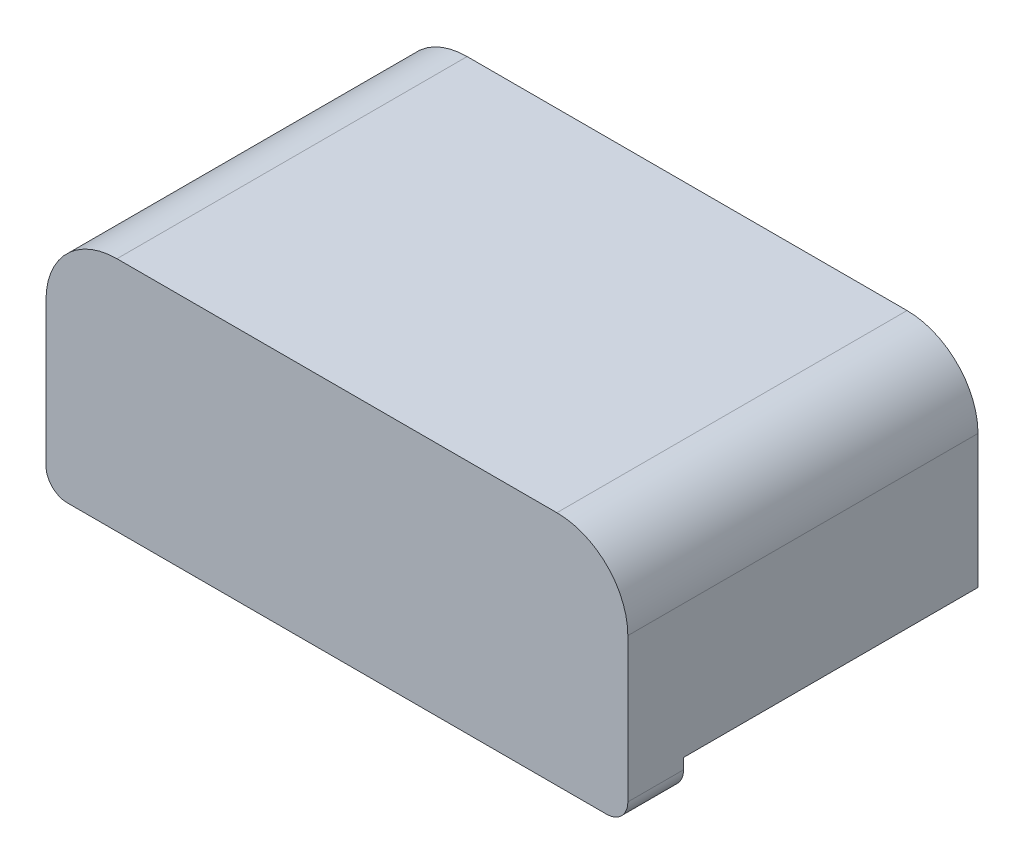
ISO-10303-21;
HEADER;
FILE_DESCRIPTION(('STEP AP214'),'2;1');
FILE_NAME('part.step','',(''),(''),'','','');
FILE_SCHEMA(('AUTOMOTIVE_DESIGN { 1 0 10303 214 1 1 1 1 }'));
ENDSEC;
DATA;
#1=APPLICATION_CONTEXT('core data for automotive mechanical design processes');
#2=APPLICATION_PROTOCOL_DEFINITION('international standard','automotive_design',2000,#1);
#3=PRODUCT_CONTEXT('',#1,'mechanical');
#4=PRODUCT('Part','Part','',(#3));
#5=PRODUCT_RELATED_PRODUCT_CATEGORY('part','',(#4));
#6=PRODUCT_DEFINITION_FORMATION('','',#4);
#7=PRODUCT_DEFINITION_CONTEXT('part definition',#1,'design');
#8=PRODUCT_DEFINITION('design','',#6,#7);
#9=PRODUCT_DEFINITION_SHAPE('','',#8);
#10=(LENGTH_UNIT() NAMED_UNIT(*) SI_UNIT(.MILLI.,.METRE.));
#11=(NAMED_UNIT(*) PLANE_ANGLE_UNIT() SI_UNIT($,.RADIAN.));
#12=(NAMED_UNIT(*) SI_UNIT($,.STERADIAN.) SOLID_ANGLE_UNIT());
#13=UNCERTAINTY_MEASURE_WITH_UNIT(LENGTH_MEASURE(1.E-05),#10,'distance_accuracy_value','');
#14=(GEOMETRIC_REPRESENTATION_CONTEXT(3) GLOBAL_UNCERTAINTY_ASSIGNED_CONTEXT((#13)) GLOBAL_UNIT_ASSIGNED_CONTEXT((#10,
#11,#12)) REPRESENTATION_CONTEXT('',''));
#15=CARTESIAN_POINT('',(0.,0.,0.));
#16=DIRECTION('',(0.,0.,1.));
#17=DIRECTION('',(1.,0.,0.));
#18=AXIS2_PLACEMENT_3D('',#15,#16,#17);
#19=CARTESIAN_POINT('',(-4.1,-0.45,0.785));
#20=DIRECTION('',(1.,0.,0.));
#21=DIRECTION('',(0.,0.,-1.));
#22=AXIS2_PLACEMENT_3D('',#19,#20,#21);
#23=PLANE('',#22);
#24=DIRECTION('',(0.,-1.,0.));
#25=VECTOR('',#24,1.);
#26=CARTESIAN_POINT('',(-4.1,-0.45,0.));
#27=LINE('',#26,#25);
#28=CARTESIAN_POINT('',(-4.1,0.,0.));
#29=VERTEX_POINT('',#28);
#30=CARTESIAN_POINT('',(-4.1,-0.15,0.));
#31=VERTEX_POINT('',#30);
#32=EDGE_CURVE('E179',#29,#31,#27,.T.);
#33=ORIENTED_EDGE('',*,*,#32,.T.);
#34=DIRECTION('',(0.,0.,-1.));
#35=VECTOR('',#34,1.);
#36=CARTESIAN_POINT('',(-4.1,-0.15,0.785));
#37=LINE('',#36,#35);
#38=CARTESIAN_POINT('',(-4.1,-0.15,0.785));
#39=VERTEX_POINT('',#38);
#40=EDGE_CURVE('E12',#31,#39,#37,.F.);
#41=ORIENTED_EDGE('',*,*,#40,.T.);
#42=DIRECTION('',(0.,-1.,0.));
#43=VECTOR('',#42,1.);
#44=CARTESIAN_POINT('',(-4.1,-0.45,0.785));
#45=LINE('',#44,#43);
#46=CARTESIAN_POINT('',(-4.1,1.88,0.785));
#47=VERTEX_POINT('',#46);
#48=EDGE_CURVE('E172',#47,#39,#45,.T.);
#49=ORIENTED_EDGE('',*,*,#48,.F.);
#50=DIRECTION('',(0.,0.,-1.));
#51=VECTOR('',#50,1.);
#52=CARTESIAN_POINT('',(-4.1,1.88,0.785));
#53=LINE('',#52,#51);
#54=CARTESIAN_POINT('',(-4.1,1.88,-4.15));
#55=VERTEX_POINT('',#54);
#56=EDGE_CURVE('E166',#47,#55,#53,.T.);
#57=ORIENTED_EDGE('',*,*,#56,.T.);
#58=DIRECTION('',(0.,1.,0.));
#59=VECTOR('',#58,1.);
#60=CARTESIAN_POINT('',(-4.1,2.88,-4.15));
#61=LINE('',#60,#59);
#62=CARTESIAN_POINT('',(-4.1,0.,-4.15));
#63=VERTEX_POINT('',#62);
#64=EDGE_CURVE('E135',#63,#55,#61,.T.);
#65=ORIENTED_EDGE('',*,*,#64,.F.);
#66=DIRECTION('',(0.,0.,1.));
#67=VECTOR('',#66,1.);
#68=CARTESIAN_POINT('',(-4.1,0.,-17.7760528706251));
#69=LINE('',#68,#67);
#70=EDGE_CURVE('E134',#63,#29,#69,.T.);
#71=ORIENTED_EDGE('',*,*,#70,.T.);
#72=EDGE_LOOP('',(#33,#41,#49,#57,#65,#71));
#73=FACE_BOUND('',#72,.T.);
#74=ADVANCED_FACE('F35',(#73),#23,.F.);
#75=CARTESIAN_POINT('',(-4.1,-0.45,0.785));
#76=DIRECTION('',(0.,1.,0.));
#77=DIRECTION('',(-1.,0.,0.));
#78=AXIS2_PLACEMENT_3D('',#75,#76,#77);
#79=PLANE('',#78);
#80=DIRECTION('',(1.,0.,0.));
#81=VECTOR('',#80,1.);
#82=CARTESIAN_POINT('',(-4.1,-0.45,0.));
#83=LINE('',#82,#81);
#84=CARTESIAN_POINT('',(-3.8,-0.45,0.));
#85=VERTEX_POINT('',#84);
#86=CARTESIAN_POINT('',(3.8,-0.45,0.));
#87=VERTEX_POINT('',#86);
#88=EDGE_CURVE('E173',#85,#87,#83,.T.);
#89=ORIENTED_EDGE('',*,*,#88,.T.);
#90=DIRECTION('',(0.,0.,-1.));
#91=VECTOR('',#90,1.);
#92=CARTESIAN_POINT('',(3.8,-0.45,0.785));
#93=LINE('',#92,#91);
#94=CARTESIAN_POINT('',(3.8,-0.45,0.785));
#95=VERTEX_POINT('',#94);
#96=EDGE_CURVE('E56',#87,#95,#93,.F.);
#97=ORIENTED_EDGE('',*,*,#96,.T.);
#98=DIRECTION('',(1.,0.,0.));
#99=VECTOR('',#98,1.);
#100=CARTESIAN_POINT('',(-4.1,-0.45,0.785));
#101=LINE('',#100,#99);
#102=CARTESIAN_POINT('',(-3.8,-0.45,0.785));
#103=VERTEX_POINT('',#102);
#104=EDGE_CURVE('E187',#103,#95,#101,.T.);
#105=ORIENTED_EDGE('',*,*,#104,.F.);
#106=DIRECTION('',(0.,0.,-1.));
#107=VECTOR('',#106,1.);
#108=CARTESIAN_POINT('',(-3.8,-0.45,0.785));
#109=LINE('',#108,#107);
#110=EDGE_CURVE('E215',#103,#85,#109,.T.);
#111=ORIENTED_EDGE('',*,*,#110,.T.);
#112=EDGE_LOOP('',(#89,#97,#105,#111));
#113=FACE_BOUND('',#112,.T.);
#114=ADVANCED_FACE('F224',(#113),#79,.F.);
#115=CARTESIAN_POINT('',(4.1,-0.45,0.785));
#116=DIRECTION('',(-1.,0.,0.));
#117=DIRECTION('',(0.,0.,1.));
#118=AXIS2_PLACEMENT_3D('',#115,#116,#117);
#119=PLANE('',#118);
#120=DIRECTION('',(0.,1.,0.));
#121=VECTOR('',#120,1.);
#122=CARTESIAN_POINT('',(4.1,-0.45,0.785));
#123=LINE('',#122,#121);
#124=CARTESIAN_POINT('',(4.1,-0.15,0.785));
#125=VERTEX_POINT('',#124);
#126=CARTESIAN_POINT('',(4.1,1.88,0.785));
#127=VERTEX_POINT('',#126);
#128=EDGE_CURVE('E185',#125,#127,#123,.T.);
#129=ORIENTED_EDGE('',*,*,#128,.F.);
#130=DIRECTION('',(0.,0.,-1.));
#131=VECTOR('',#130,1.);
#132=CARTESIAN_POINT('',(4.1,-0.15,0.785));
#133=LINE('',#132,#131);
#134=CARTESIAN_POINT('',(4.1,-0.15,0.));
#135=VERTEX_POINT('',#134);
#136=EDGE_CURVE('E169',#125,#135,#133,.T.);
#137=ORIENTED_EDGE('',*,*,#136,.T.);
#138=DIRECTION('',(0.,1.,0.));
#139=VECTOR('',#138,1.);
#140=CARTESIAN_POINT('',(4.1,-0.45,0.));
#141=LINE('',#140,#139);
#142=CARTESIAN_POINT('',(4.1,0.,0.));
#143=VERTEX_POINT('',#142);
#144=EDGE_CURVE('E141',#135,#143,#141,.T.);
#145=ORIENTED_EDGE('',*,*,#144,.T.);
#146=DIRECTION('',(0.,0.,1.));
#147=VECTOR('',#146,1.);
#148=CARTESIAN_POINT('',(4.1,0.,-17.7760528706251));
#149=LINE('',#148,#147);
#150=CARTESIAN_POINT('',(4.1,0.,-4.15));
#151=VERTEX_POINT('',#150);
#152=EDGE_CURVE('E132',#151,#143,#149,.T.);
#153=ORIENTED_EDGE('',*,*,#152,.F.);
#154=DIRECTION('',(0.,-1.,0.));
#155=VECTOR('',#154,1.);
#156=CARTESIAN_POINT('',(4.1,2.88,-4.15));
#157=LINE('',#156,#155);
#158=CARTESIAN_POINT('',(4.1,1.88,-4.15));
#159=VERTEX_POINT('',#158);
#160=EDGE_CURVE('E114',#159,#151,#157,.T.);
#161=ORIENTED_EDGE('',*,*,#160,.F.);
#162=DIRECTION('',(0.,0.,-1.));
#163=VECTOR('',#162,1.);
#164=CARTESIAN_POINT('',(4.1,1.88,0.785));
#165=LINE('',#164,#163);
#166=EDGE_CURVE('E160',#159,#127,#165,.F.);
#167=ORIENTED_EDGE('',*,*,#166,.T.);
#168=EDGE_LOOP('',(#129,#137,#145,#153,#161,#167));
#169=FACE_BOUND('',#168,.T.);
#170=ADVANCED_FACE('F138',(#169),#119,.F.);
#171=CARTESIAN_POINT('',(-4.1,2.88,0.785));
#172=DIRECTION('',(0.,-1.,0.));
#173=DIRECTION('',(0.,0.,-1.));
#174=AXIS2_PLACEMENT_3D('',#171,#172,#173);
#175=PLANE('',#174);
#176=DIRECTION('',(-1.,0.,0.));
#177=VECTOR('',#176,1.);
#178=CARTESIAN_POINT('',(-4.1,2.88,0.785));
#179=LINE('',#178,#177);
#180=CARTESIAN_POINT('',(3.1,2.88,0.785));
#181=VERTEX_POINT('',#180);
#182=CARTESIAN_POINT('',(-3.1,2.88,0.785));
#183=VERTEX_POINT('',#182);
#184=EDGE_CURVE('E154',#181,#183,#179,.T.);
#185=ORIENTED_EDGE('',*,*,#184,.F.);
#186=DIRECTION('',(0.,0.,-1.));
#187=VECTOR('',#186,1.);
#188=CARTESIAN_POINT('',(3.1,2.88,0.785));
#189=LINE('',#188,#187);
#190=CARTESIAN_POINT('',(3.1,2.88,-4.15));
#191=VERTEX_POINT('',#190);
#192=EDGE_CURVE('E153',#181,#191,#189,.T.);
#193=ORIENTED_EDGE('',*,*,#192,.T.);
#194=DIRECTION('',(1.,0.,0.));
#195=VECTOR('',#194,1.);
#196=CARTESIAN_POINT('',(4.1,2.88,-4.15));
#197=LINE('',#196,#195);
#198=CARTESIAN_POINT('',(-3.1,2.88,-4.15));
#199=VERTEX_POINT('',#198);
#200=EDGE_CURVE('E125',#199,#191,#197,.T.);
#201=ORIENTED_EDGE('',*,*,#200,.F.);
#202=DIRECTION('',(0.,0.,-1.));
#203=VECTOR('',#202,1.);
#204=CARTESIAN_POINT('',(-3.1,2.88,0.785));
#205=LINE('',#204,#203);
#206=EDGE_CURVE('E151',#199,#183,#205,.F.);
#207=ORIENTED_EDGE('',*,*,#206,.T.);
#208=EDGE_LOOP('',(#185,#193,#201,#207));
#209=FACE_BOUND('',#208,.T.);
#210=ADVANCED_FACE('F200',(#209),#175,.F.);
#211=CARTESIAN_POINT('',(0.,0.,0.785));
#212=DIRECTION('',(0.,0.,-1.));
#213=DIRECTION('',(-1.,0.,0.));
#214=AXIS2_PLACEMENT_3D('',#211,#212,#213);
#215=PLANE('',#214);
#216=ORIENTED_EDGE('',*,*,#104,.T.);
#217=CARTESIAN_POINT('',(3.8,-0.15,0.785));
#218=DIRECTION('',(0.,0.,-1.));
#219=DIRECTION('',(-1.,0.,0.));
#220=AXIS2_PLACEMENT_3D('',#217,#218,#219);
#221=CIRCLE('',#220,0.3);
#222=EDGE_CURVE('E43',#95,#125,#221,.F.);
#223=ORIENTED_EDGE('',*,*,#222,.T.);
#224=ORIENTED_EDGE('',*,*,#128,.T.);
#225=CARTESIAN_POINT('',(3.1,1.88,0.785));
#226=DIRECTION('',(0.,0.,-1.));
#227=DIRECTION('',(-1.,0.,0.));
#228=AXIS2_PLACEMENT_3D('',#225,#226,#227);
#229=CIRCLE('',#228,1.);
#230=EDGE_CURVE('E164',#127,#181,#229,.F.);
#231=ORIENTED_EDGE('',*,*,#230,.T.);
#232=ORIENTED_EDGE('',*,*,#184,.T.);
#233=CARTESIAN_POINT('',(-3.1,1.88,0.785));
#234=DIRECTION('',(0.,0.,-1.));
#235=DIRECTION('',(-1.,0.,0.));
#236=AXIS2_PLACEMENT_3D('',#233,#234,#235);
#237=CIRCLE('',#236,1.);
#238=EDGE_CURVE('E162',#183,#47,#237,.F.);
#239=ORIENTED_EDGE('',*,*,#238,.T.);
#240=ORIENTED_EDGE('',*,*,#48,.T.);
#241=CARTESIAN_POINT('',(-3.8,-0.15,0.785));
#242=DIRECTION('',(0.,0.,-1.));
#243=DIRECTION('',(-1.,0.,0.));
#244=AXIS2_PLACEMENT_3D('',#241,#242,#243);
#245=CIRCLE('',#244,0.3);
#246=EDGE_CURVE('E221',#39,#103,#245,.F.);
#247=ORIENTED_EDGE('',*,*,#246,.T.);
#248=EDGE_LOOP('',(#216,#223,#224,#231,#232,#239,#240,#247));
#249=FACE_BOUND('',#248,.T.);
#250=ADVANCED_FACE('F203',(#249),#215,.F.);
#251=CARTESIAN_POINT('',(0.,0.,0.));
#252=DIRECTION('',(0.,0.,-1.));
#253=DIRECTION('',(-1.,0.,0.));
#254=AXIS2_PLACEMENT_3D('',#251,#252,#253);
#255=PLANE('',#254);
#256=ORIENTED_EDGE('',*,*,#144,.F.);
#257=CARTESIAN_POINT('',(3.8,-0.15,0.));
#258=DIRECTION('',(0.,0.,-1.));
#259=DIRECTION('',(-1.,0.,0.));
#260=AXIS2_PLACEMENT_3D('',#257,#258,#259);
#261=CIRCLE('',#260,0.3);
#262=EDGE_CURVE('E211',#135,#87,#261,.T.);
#263=ORIENTED_EDGE('',*,*,#262,.T.);
#264=ORIENTED_EDGE('',*,*,#88,.F.);
#265=CARTESIAN_POINT('',(-3.8,-0.15,0.));
#266=DIRECTION('',(0.,0.,-1.));
#267=DIRECTION('',(-1.,0.,0.));
#268=AXIS2_PLACEMENT_3D('',#265,#266,#267);
#269=CIRCLE('',#268,0.3);
#270=EDGE_CURVE('E212',#85,#31,#269,.T.);
#271=ORIENTED_EDGE('',*,*,#270,.T.);
#272=ORIENTED_EDGE('',*,*,#32,.F.);
#273=DIRECTION('',(-1.,0.,0.));
#274=VECTOR('',#273,1.);
#275=CARTESIAN_POINT('',(4.1,0.,0.));
#276=LINE('',#275,#274);
#277=EDGE_CURVE('E143',#143,#29,#276,.T.);
#278=ORIENTED_EDGE('',*,*,#277,.F.);
#279=EDGE_LOOP('',(#256,#263,#264,#271,#272,#278));
#280=FACE_BOUND('',#279,.T.);
#281=ADVANCED_FACE('F256',(#280),#255,.T.);
#282=CARTESIAN_POINT('',(4.1,0.,-17.7760528706251));
#283=DIRECTION('',(0.,1.,0.));
#284=DIRECTION('',(0.,0.,1.));
#285=AXIS2_PLACEMENT_3D('',#282,#283,#284);
#286=PLANE('',#285);
#287=DIRECTION('',(-1.,0.,0.));
#288=VECTOR('',#287,1.);
#289=CARTESIAN_POINT('',(4.1,0.,-4.15));
#290=LINE('',#289,#288);
#291=EDGE_CURVE('E119',#151,#63,#290,.T.);
#292=ORIENTED_EDGE('',*,*,#291,.F.);
#293=ORIENTED_EDGE('',*,*,#152,.T.);
#294=ORIENTED_EDGE('',*,*,#277,.T.);
#295=ORIENTED_EDGE('',*,*,#70,.F.);
#296=EDGE_LOOP('',(#292,#293,#294,#295));
#297=FACE_BOUND('',#296,.T.);
#298=ADVANCED_FACE('F130',(#297),#286,.F.);
#299=CARTESIAN_POINT('',(0.,0.,-4.15));
#300=DIRECTION('',(0.,0.,-1.));
#301=DIRECTION('',(-1.,0.,0.));
#302=AXIS2_PLACEMENT_3D('',#299,#300,#301);
#303=PLANE('',#302);
#304=ORIENTED_EDGE('',*,*,#200,.T.);
#305=CARTESIAN_POINT('',(3.1,1.88,-4.15));
#306=DIRECTION('',(0.,0.,-1.));
#307=DIRECTION('',(-1.,0.,0.));
#308=AXIS2_PLACEMENT_3D('',#305,#306,#307);
#309=CIRCLE('',#308,1.);
#310=EDGE_CURVE('E120',#191,#159,#309,.T.);
#311=ORIENTED_EDGE('',*,*,#310,.T.);
#312=ORIENTED_EDGE('',*,*,#160,.T.);
#313=ORIENTED_EDGE('',*,*,#291,.T.);
#314=ORIENTED_EDGE('',*,*,#64,.T.);
#315=CARTESIAN_POINT('',(-3.1,1.88,-4.15));
#316=DIRECTION('',(0.,0.,-1.));
#317=DIRECTION('',(-1.,0.,0.));
#318=AXIS2_PLACEMENT_3D('',#315,#316,#317);
#319=CIRCLE('',#318,1.);
#320=EDGE_CURVE('E157',#55,#199,#319,.T.);
#321=ORIENTED_EDGE('',*,*,#320,.T.);
#322=EDGE_LOOP('',(#304,#311,#312,#313,#314,#321));
#323=FACE_BOUND('',#322,.T.);
#324=ADVANCED_FACE('F117',(#323),#303,.T.);
#325=CARTESIAN_POINT('',(3.1,1.88,0.785));
#326=DIRECTION('',(0.,0.,-1.));
#327=DIRECTION('',(-1.,0.,0.));
#328=AXIS2_PLACEMENT_3D('',#325,#326,#327);
#329=CYLINDRICAL_SURFACE('',#328,1.);
#330=ORIENTED_EDGE('',*,*,#230,.F.);
#331=ORIENTED_EDGE('',*,*,#166,.F.);
#332=ORIENTED_EDGE('',*,*,#310,.F.);
#333=ORIENTED_EDGE('',*,*,#192,.F.);
#334=EDGE_LOOP('',(#330,#331,#332,#333));
#335=FACE_BOUND('',#334,.T.);
#336=ADVANCED_FACE('F206',(#335),#329,.T.);
#337=CARTESIAN_POINT('',(-3.1,1.88,0.785));
#338=DIRECTION('',(0.,0.,-1.));
#339=DIRECTION('',(-1.,0.,0.));
#340=AXIS2_PLACEMENT_3D('',#337,#338,#339);
#341=CYLINDRICAL_SURFACE('',#340,1.);
#342=ORIENTED_EDGE('',*,*,#238,.F.);
#343=ORIENTED_EDGE('',*,*,#206,.F.);
#344=ORIENTED_EDGE('',*,*,#320,.F.);
#345=ORIENTED_EDGE('',*,*,#56,.F.);
#346=EDGE_LOOP('',(#342,#343,#344,#345));
#347=FACE_BOUND('',#346,.T.);
#348=ADVANCED_FACE('F196',(#347),#341,.T.);
#349=CARTESIAN_POINT('',(3.8,-0.15,0.785));
#350=DIRECTION('',(0.,0.,-1.));
#351=DIRECTION('',(-1.,0.,0.));
#352=AXIS2_PLACEMENT_3D('',#349,#350,#351);
#353=CYLINDRICAL_SURFACE('',#352,0.3);
#354=ORIENTED_EDGE('',*,*,#222,.F.);
#355=ORIENTED_EDGE('',*,*,#96,.F.);
#356=ORIENTED_EDGE('',*,*,#262,.F.);
#357=ORIENTED_EDGE('',*,*,#136,.F.);
#358=EDGE_LOOP('',(#354,#355,#356,#357));
#359=FACE_BOUND('',#358,.T.);
#360=ADVANCED_FACE('F210',(#359),#353,.T.);
#361=CARTESIAN_POINT('',(-3.8,-0.15,0.785));
#362=DIRECTION('',(0.,0.,-1.));
#363=DIRECTION('',(-1.,0.,0.));
#364=AXIS2_PLACEMENT_3D('',#361,#362,#363);
#365=CYLINDRICAL_SURFACE('',#364,0.3);
#366=ORIENTED_EDGE('',*,*,#246,.F.);
#367=ORIENTED_EDGE('',*,*,#40,.F.);
#368=ORIENTED_EDGE('',*,*,#270,.F.);
#369=ORIENTED_EDGE('',*,*,#110,.F.);
#370=EDGE_LOOP('',(#366,#367,#368,#369));
#371=FACE_BOUND('',#370,.T.);
#372=ADVANCED_FACE('F37',(#371),#365,.T.);
#373=CLOSED_SHELL('',(#74,#114,#170,#210,#250,#281,#298,#324,#336,#348,#360,#372));
#374=MANIFOLD_SOLID_BREP('B2',#373);
#375=ADVANCED_BREP_SHAPE_REPRESENTATION('',(#18,#374),#14);
#376=SHAPE_DEFINITION_REPRESENTATION(#9,#375);
ENDSEC;
END-ISO-10303-21;
